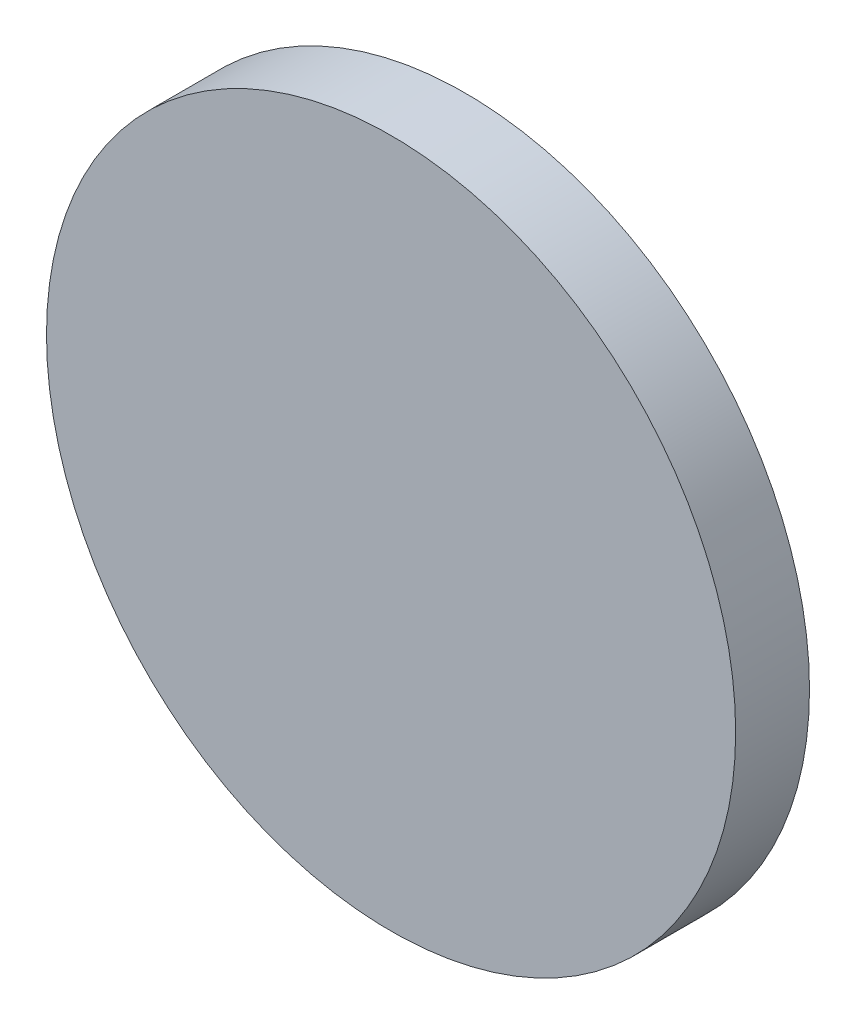
ISO-10303-21;
HEADER;
FILE_DESCRIPTION(('STEP AP214'),'2;1');
FILE_NAME('part.step','',(''),(''),'','','');
FILE_SCHEMA(('AUTOMOTIVE_DESIGN { 1 0 10303 214 1 1 1 1 }'));
ENDSEC;
DATA;
#1=APPLICATION_CONTEXT('core data for automotive mechanical design processes');
#2=APPLICATION_PROTOCOL_DEFINITION('international standard','automotive_design',2000,#1);
#3=PRODUCT_CONTEXT('',#1,'mechanical');
#4=PRODUCT('Part','Part','',(#3));
#5=PRODUCT_RELATED_PRODUCT_CATEGORY('part','',(#4));
#6=PRODUCT_DEFINITION_FORMATION('','',#4);
#7=PRODUCT_DEFINITION_CONTEXT('part definition',#1,'design');
#8=PRODUCT_DEFINITION('design','',#6,#7);
#9=PRODUCT_DEFINITION_SHAPE('','',#8);
#10=(LENGTH_UNIT() NAMED_UNIT(*) SI_UNIT(.MILLI.,.METRE.));
#11=(NAMED_UNIT(*) PLANE_ANGLE_UNIT() SI_UNIT($,.RADIAN.));
#12=(NAMED_UNIT(*) SI_UNIT($,.STERADIAN.) SOLID_ANGLE_UNIT());
#13=UNCERTAINTY_MEASURE_WITH_UNIT(LENGTH_MEASURE(1.E-05),#10,'distance_accuracy_value','');
#14=(GEOMETRIC_REPRESENTATION_CONTEXT(3) GLOBAL_UNCERTAINTY_ASSIGNED_CONTEXT((#13)) GLOBAL_UNIT_ASSIGNED_CONTEXT((#10,
#11,#12)) REPRESENTATION_CONTEXT('',''));
#15=CARTESIAN_POINT('',(0.,0.,0.));
#16=DIRECTION('',(0.,0.,1.));
#17=DIRECTION('',(1.,0.,0.));
#18=AXIS2_PLACEMENT_3D('',#15,#16,#17);
#19=CARTESIAN_POINT('',(0.,0.,3.));
#20=DIRECTION('',(0.,0.,-1.));
#21=DIRECTION('',(-1.,0.,0.));
#22=AXIS2_PLACEMENT_3D('',#19,#20,#21);
#23=CYLINDRICAL_SURFACE('',#22,14.);
#24=CARTESIAN_POINT('',(0.,0.,3.));
#25=DIRECTION('',(0.,0.,1.));
#26=DIRECTION('',(1.,0.,0.));
#27=AXIS2_PLACEMENT_3D('',#24,#25,#26);
#28=CIRCLE('',#27,14.);
#29=CARTESIAN_POINT('',(14.,0.,3.));
#30=VERTEX_POINT('',#29);
#31=EDGE_CURVE('E10',#30,#30,#28,.T.);
#32=ORIENTED_EDGE('',*,*,#31,.F.);
#33=EDGE_LOOP('',(#32));
#34=FACE_BOUND('',#33,.T.);
#35=CARTESIAN_POINT('',(0.,0.,0.));
#36=DIRECTION('',(0.,0.,1.));
#37=DIRECTION('',(1.,0.,0.));
#38=AXIS2_PLACEMENT_3D('',#35,#36,#37);
#39=CIRCLE('',#38,14.);
#40=CARTESIAN_POINT('',(14.,0.,0.));
#41=VERTEX_POINT('',#40);
#42=EDGE_CURVE('E35',#41,#41,#39,.T.);
#43=ORIENTED_EDGE('',*,*,#42,.T.);
#44=EDGE_LOOP('',(#43));
#45=FACE_BOUND('',#44,.T.);
#46=ADVANCED_FACE('F32',(#34,#45),#23,.T.);
#47=CARTESIAN_POINT('',(0.,0.,3.));
#48=DIRECTION('',(0.,0.,1.));
#49=DIRECTION('',(1.,0.,0.));
#50=AXIS2_PLACEMENT_3D('',#47,#48,#49);
#51=PLANE('',#50);
#52=ORIENTED_EDGE('',*,*,#31,.T.);
#53=EDGE_LOOP('',(#52));
#54=FACE_BOUND('',#53,.T.);
#55=ADVANCED_FACE('F47',(#54),#51,.T.);
#56=CARTESIAN_POINT('',(0.,0.,0.));
#57=DIRECTION('',(0.,0.,1.));
#58=DIRECTION('',(1.,0.,0.));
#59=AXIS2_PLACEMENT_3D('',#56,#57,#58);
#60=PLANE('',#59);
#61=ORIENTED_EDGE('',*,*,#42,.F.);
#62=EDGE_LOOP('',(#61));
#63=FACE_BOUND('',#62,.T.);
#64=ADVANCED_FACE('F45',(#63),#60,.F.);
#65=CLOSED_SHELL('',(#46,#55,#64));
#66=MANIFOLD_SOLID_BREP('B2',#65);
#67=ADVANCED_BREP_SHAPE_REPRESENTATION('',(#18,#66),#14);
#68=SHAPE_DEFINITION_REPRESENTATION(#9,#67);
ENDSEC;
END-ISO-10303-21;
